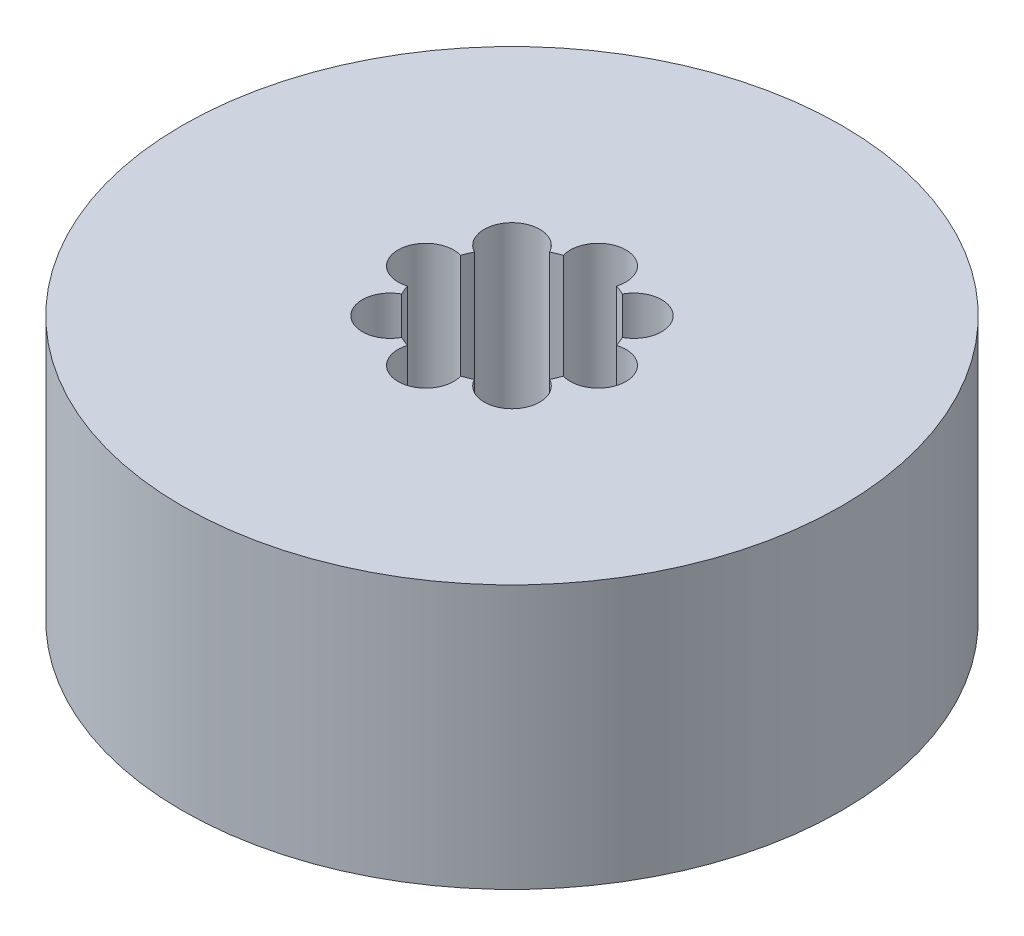
ISO-10303-21;
HEADER;
FILE_DESCRIPTION(('STEP AP214'),'2;1');
FILE_NAME('part.step','',(''),(''),'','','');
FILE_SCHEMA(('AUTOMOTIVE_DESIGN { 1 0 10303 214 1 1 1 1 }'));
ENDSEC;
DATA;
#1=APPLICATION_CONTEXT('core data for automotive mechanical design processes');
#2=APPLICATION_PROTOCOL_DEFINITION('international standard','automotive_design',2000,#1);
#3=PRODUCT_CONTEXT('',#1,'mechanical');
#4=PRODUCT('Part','Part','',(#3));
#5=PRODUCT_RELATED_PRODUCT_CATEGORY('part','',(#4));
#6=PRODUCT_DEFINITION_FORMATION('','',#4);
#7=PRODUCT_DEFINITION_CONTEXT('part definition',#1,'design');
#8=PRODUCT_DEFINITION('design','',#6,#7);
#9=PRODUCT_DEFINITION_SHAPE('','',#8);
#10=(LENGTH_UNIT() NAMED_UNIT(*) SI_UNIT(.MILLI.,.METRE.));
#11=(NAMED_UNIT(*) PLANE_ANGLE_UNIT() SI_UNIT($,.RADIAN.));
#12=(NAMED_UNIT(*) SI_UNIT($,.STERADIAN.) SOLID_ANGLE_UNIT());
#13=UNCERTAINTY_MEASURE_WITH_UNIT(LENGTH_MEASURE(1.E-05),#10,'distance_accuracy_value','');
#14=(GEOMETRIC_REPRESENTATION_CONTEXT(3) GLOBAL_UNCERTAINTY_ASSIGNED_CONTEXT((#13)) GLOBAL_UNIT_ASSIGNED_CONTEXT((#10,
#11,#12)) REPRESENTATION_CONTEXT('',''));
#15=CARTESIAN_POINT('',(0.,0.,0.));
#16=DIRECTION('',(0.,0.,1.));
#17=DIRECTION('',(1.,0.,0.));
#18=AXIS2_PLACEMENT_3D('',#15,#16,#17);
#19=CARTESIAN_POINT('',(0.,16.,0.));
#20=DIRECTION('',(0.,-1.,0.));
#21=DIRECTION('',(0.,0.,-1.));
#22=AXIS2_PLACEMENT_3D('',#19,#20,#21);
#23=CYLINDRICAL_SURFACE('',#22,20.);
#24=CARTESIAN_POINT('',(0.,16.,0.));
#25=DIRECTION('',(0.,1.,0.));
#26=DIRECTION('',(0.,0.,1.));
#27=AXIS2_PLACEMENT_3D('',#24,#25,#26);
#28=CIRCLE('',#27,20.);
#29=CARTESIAN_POINT('',(0.,16.,20.));
#30=VERTEX_POINT('',#29);
#31=EDGE_CURVE('E195',#30,#30,#28,.T.);
#32=ORIENTED_EDGE('',*,*,#31,.F.);
#33=EDGE_LOOP('',(#32));
#34=FACE_BOUND('',#33,.T.);
#35=CARTESIAN_POINT('',(0.,0.,0.));
#36=DIRECTION('',(0.,1.,0.));
#37=DIRECTION('',(0.,0.,1.));
#38=AXIS2_PLACEMENT_3D('',#35,#36,#37);
#39=CIRCLE('',#38,20.);
#40=CARTESIAN_POINT('',(0.,0.,20.));
#41=VERTEX_POINT('',#40);
#42=EDGE_CURVE('E179',#41,#41,#39,.T.);
#43=ORIENTED_EDGE('',*,*,#42,.T.);
#44=EDGE_LOOP('',(#43));
#45=FACE_BOUND('',#44,.T.);
#46=ADVANCED_FACE('F39',(#34,#45),#23,.T.);
#47=CARTESIAN_POINT('',(0.,16.,0.));
#48=DIRECTION('',(0.,1.,0.));
#49=DIRECTION('',(0.,0.,1.));
#50=AXIS2_PLACEMENT_3D('',#47,#48,#49);
#51=PLANE('',#50);
#52=CARTESIAN_POINT('',(0.,16.,5.22813348136023));
#53=DIRECTION('',(0.,1.,0.));
#54=DIRECTION('',(1.,0.,0.));
#55=AXIS2_PLACEMENT_3D('',#52,#53,#54);
#56=CIRCLE('',#55,1.68699486235413);
#57=CARTESIAN_POINT('',(-1.61263670500223,16.,4.73280074138766));
#58=VERTEX_POINT('',#57);
#59=CARTESIAN_POINT('',(1.61263670500226,16.,4.73280074138765));
#60=VERTEX_POINT('',#59);
#61=EDGE_CURVE('E176',#58,#60,#56,.T.);
#62=ORIENTED_EDGE('',*,*,#61,.F.);
#63=CARTESIAN_POINT('',(0.,16.,0.));
#64=DIRECTION('',(0.,1.,0.));
#65=DIRECTION('',(0.,0.,1.));
#66=AXIS2_PLACEMENT_3D('',#63,#64,#65);
#67=CIRCLE('',#66,5.);
#68=CARTESIAN_POINT('',(-2.2062891485425,16.,4.48690184793735));
#69=VERTEX_POINT('',#68);
#70=EDGE_CURVE('E166',#69,#58,#67,.T.);
#71=ORIENTED_EDGE('',*,*,#70,.F.);
#72=CARTESIAN_POINT('',(-3.69684863761824,16.,3.69684863761826));
#73=DIRECTION('',(0.,1.,0.));
#74=DIRECTION('',(0.707106781186549,0.,0.707106781186546));
#75=AXIS2_PLACEMENT_3D('',#72,#73,#74);
#76=CIRCLE('',#75,1.68699486235413);
#77=CARTESIAN_POINT('',(-4.48690184793734,16.,2.20628914854252));
#78=VERTEX_POINT('',#77);
#79=EDGE_CURVE('E147',#78,#69,#76,.T.);
#80=ORIENTED_EDGE('',*,*,#79,.F.);
#81=CARTESIAN_POINT('',(-4.73280074138765,16.,1.61263670500225));
#82=VERTEX_POINT('',#81);
#83=EDGE_CURVE('E180',#82,#78,#67,.T.);
#84=ORIENTED_EDGE('',*,*,#83,.F.);
#85=CARTESIAN_POINT('',(-5.22813348136023,16.,0.));
#86=DIRECTION('',(0.,1.,0.));
#87=DIRECTION('',(0.,0.,1.));
#88=AXIS2_PLACEMENT_3D('',#85,#86,#87);
#89=CIRCLE('',#88,1.68699486235413);
#90=CARTESIAN_POINT('',(-4.73280074138765,16.,-1.61263670500225));
#91=VERTEX_POINT('',#90);
#92=EDGE_CURVE('E186',#91,#82,#89,.T.);
#93=ORIENTED_EDGE('',*,*,#92,.F.);
#94=CARTESIAN_POINT('',(-4.48690184793737,16.,-2.20628914854245));
#95=VERTEX_POINT('',#94);
#96=EDGE_CURVE('E182',#95,#91,#67,.T.);
#97=ORIENTED_EDGE('',*,*,#96,.F.);
#98=CARTESIAN_POINT('',(-3.69684863761829,16.,-3.6968486376182));
#99=DIRECTION('',(0.,1.,0.));
#100=DIRECTION('',(-0.707106781186539,0.,0.707106781186556));
#101=AXIS2_PLACEMENT_3D('',#98,#99,#100);
#102=CIRCLE('',#101,1.68699486235413);
#103=CARTESIAN_POINT('',(-2.20628914854256,16.,-4.48690184793732));
#104=VERTEX_POINT('',#103);
#105=EDGE_CURVE('E446',#104,#95,#102,.T.);
#106=ORIENTED_EDGE('',*,*,#105,.F.);
#107=CARTESIAN_POINT('',(-1.6126367050023,16.,-4.73280074138763));
#108=VERTEX_POINT('',#107);
#109=EDGE_CURVE('E452',#108,#104,#67,.T.);
#110=ORIENTED_EDGE('',*,*,#109,.F.);
#111=CARTESIAN_POINT('',(0.,16.,-5.22813348136023));
#112=DIRECTION('',(0.,1.,0.));
#113=DIRECTION('',(-1.,0.,0.));
#114=AXIS2_PLACEMENT_3D('',#111,#112,#113);
#115=CIRCLE('',#114,1.68699486235413);
#116=CARTESIAN_POINT('',(1.6126367050022,16.,-4.73280074138767));
#117=VERTEX_POINT('',#116);
#118=EDGE_CURVE('E477',#117,#108,#115,.T.);
#119=ORIENTED_EDGE('',*,*,#118,.F.);
#120=CARTESIAN_POINT('',(2.20628914854247,16.,-4.48690184793737));
#121=VERTEX_POINT('',#120);
#122=EDGE_CURVE('E460',#121,#117,#67,.T.);
#123=ORIENTED_EDGE('',*,*,#122,.F.);
#124=CARTESIAN_POINT('',(3.69684863761822,16.,-3.69684863761828));
#125=DIRECTION('',(0.,1.,0.));
#126=DIRECTION('',(-0.707106781186554,0.,-0.707106781186541));
#127=AXIS2_PLACEMENT_3D('',#124,#125,#126);
#128=CIRCLE('',#127,1.68699486235413);
#129=CARTESIAN_POINT('',(4.48690184793733,16.,-2.20628914854255));
#130=VERTEX_POINT('',#129);
#131=EDGE_CURVE('E464',#130,#121,#128,.T.);
#132=ORIENTED_EDGE('',*,*,#131,.F.);
#133=CARTESIAN_POINT('',(4.73280074138765,16.,-1.61263670500225));
#134=VERTEX_POINT('',#133);
#135=EDGE_CURVE('E459',#134,#130,#67,.T.);
#136=ORIENTED_EDGE('',*,*,#135,.F.);
#137=CARTESIAN_POINT('',(5.22813348136023,16.,0.));
#138=DIRECTION('',(0.,1.,0.));
#139=DIRECTION('',(0.,0.,-1.));
#140=AXIS2_PLACEMENT_3D('',#137,#138,#139);
#141=CIRCLE('',#140,1.68699486235413);
#142=CARTESIAN_POINT('',(4.73280074138765,16.,1.61263670500225));
#143=VERTEX_POINT('',#142);
#144=EDGE_CURVE('E469',#143,#134,#141,.T.);
#145=ORIENTED_EDGE('',*,*,#144,.F.);
#146=CARTESIAN_POINT('',(4.48690184793736,16.,2.20628914854249));
#147=VERTEX_POINT('',#146);
#148=EDGE_CURVE('E181',#147,#143,#67,.T.);
#149=ORIENTED_EDGE('',*,*,#148,.F.);
#150=CARTESIAN_POINT('',(3.69684863761827,16.,3.69684863761823));
#151=DIRECTION('',(0.,1.,0.));
#152=DIRECTION('',(0.707106781186544,0.,-0.707106781186551));
#153=AXIS2_PLACEMENT_3D('',#150,#151,#152);
#154=CIRCLE('',#153,1.68699486235413);
#155=CARTESIAN_POINT('',(2.20628914854253,16.,4.48690184793734));
#156=VERTEX_POINT('',#155);
#157=EDGE_CURVE('E475',#156,#147,#154,.T.);
#158=ORIENTED_EDGE('',*,*,#157,.F.);
#159=EDGE_CURVE('E177',#60,#156,#67,.T.);
#160=ORIENTED_EDGE('',*,*,#159,.F.);
#161=EDGE_LOOP('',(#62,#71,#80,#84,#93,#97,#106,#110,#119,#123,#132,#136,#145,#149,#158,#160));
#162=FACE_BOUND('',#161,.T.);
#163=ORIENTED_EDGE('',*,*,#31,.T.);
#164=EDGE_LOOP('',(#163));
#165=FACE_BOUND('',#164,.T.);
#166=ADVANCED_FACE('F172',(#162,#165),#51,.T.);
#167=CARTESIAN_POINT('',(0.,0.,0.));
#168=DIRECTION('',(0.,1.,0.));
#169=DIRECTION('',(0.,0.,1.));
#170=AXIS2_PLACEMENT_3D('',#167,#168,#169);
#171=PLANE('',#170);
#172=CARTESIAN_POINT('',(0.,0.,0.));
#173=DIRECTION('',(0.,1.,0.));
#174=DIRECTION('',(0.,0.,1.));
#175=AXIS2_PLACEMENT_3D('',#172,#173,#174);
#176=CIRCLE('',#175,5.);
#177=CARTESIAN_POINT('',(0.,0.,5.));
#178=VERTEX_POINT('',#177);
#179=EDGE_CURVE('E187',#178,#178,#176,.T.);
#180=ORIENTED_EDGE('',*,*,#179,.T.);
#181=EDGE_LOOP('',(#180));
#182=FACE_BOUND('',#181,.T.);
#183=ORIENTED_EDGE('',*,*,#42,.F.);
#184=EDGE_LOOP('',(#183));
#185=FACE_BOUND('',#184,.T.);
#186=ADVANCED_FACE('F270',(#182,#185),#171,.F.);
#187=CARTESIAN_POINT('',(0.,16.,0.));
#188=DIRECTION('',(0.,-1.,0.));
#189=DIRECTION('',(0.,0.,-1.));
#190=AXIS2_PLACEMENT_3D('',#187,#188,#189);
#191=CYLINDRICAL_SURFACE('',#190,5.);
#192=DIRECTION('',(0.,1.,0.));
#193=VECTOR('',#192,1.);
#194=CARTESIAN_POINT('',(-1.61263670500223,9.82098684357305,4.73280074138766));
#195=LINE('',#194,#193);
#196=CARTESIAN_POINT('',(-1.61263670500223,3.64197368714609,4.73280074138766));
#197=VERTEX_POINT('',#196);
#198=EDGE_CURVE('E11',#197,#58,#195,.T.);
#199=ORIENTED_EDGE('',*,*,#198,.F.);
#200=CARTESIAN_POINT('',(0.,3.64197368714609,0.));
#201=DIRECTION('',(0.,1.,0.));
#202=DIRECTION('',(0.,0.,1.));
#203=AXIS2_PLACEMENT_3D('',#200,#201,#202);
#204=CIRCLE('',#203,5.);
#205=CARTESIAN_POINT('',(1.61263670500226,3.64197368714609,4.73280074138765));
#206=VERTEX_POINT('',#205);
#207=EDGE_CURVE('E250',#197,#206,#204,.T.);
#208=ORIENTED_EDGE('',*,*,#207,.T.);
#209=DIRECTION('',(0.,1.,0.));
#210=VECTOR('',#209,1.);
#211=CARTESIAN_POINT('',(1.61263670500226,9.82098684357305,4.73280074138765));
#212=LINE('',#211,#210);
#213=EDGE_CURVE('E46',#60,#206,#212,.F.);
#214=ORIENTED_EDGE('',*,*,#213,.F.);
#215=ORIENTED_EDGE('',*,*,#159,.T.);
#216=DIRECTION('',(0.,1.,0.));
#217=VECTOR('',#216,1.);
#218=CARTESIAN_POINT('',(2.20628914854253,9.82098684357305,4.48690184793734));
#219=LINE('',#218,#217);
#220=CARTESIAN_POINT('',(2.20628914854253,3.64197368714609,4.48690184793734));
#221=VERTEX_POINT('',#220);
#222=EDGE_CURVE('E244',#221,#156,#219,.T.);
#223=ORIENTED_EDGE('',*,*,#222,.F.);
#224=CARTESIAN_POINT('',(0.,3.64197368714609,0.));
#225=DIRECTION('',(0.,1.,0.));
#226=DIRECTION('',(0.,0.,1.));
#227=AXIS2_PLACEMENT_3D('',#224,#225,#226);
#228=CIRCLE('',#227,5.);
#229=CARTESIAN_POINT('',(4.48690184793736,3.64197368714609,2.20628914854249));
#230=VERTEX_POINT('',#229);
#231=EDGE_CURVE('E238',#221,#230,#228,.T.);
#232=ORIENTED_EDGE('',*,*,#231,.T.);
#233=DIRECTION('',(0.,1.,0.));
#234=VECTOR('',#233,1.);
#235=CARTESIAN_POINT('',(4.48690184793736,9.82098684357305,2.20628914854248));
#236=LINE('',#235,#234);
#237=EDGE_CURVE('E242',#147,#230,#236,.F.);
#238=ORIENTED_EDGE('',*,*,#237,.F.);
#239=ORIENTED_EDGE('',*,*,#148,.T.);
#240=DIRECTION('',(0.,1.,0.));
#241=VECTOR('',#240,1.);
#242=CARTESIAN_POINT('',(4.73280074138765,9.82098684357305,1.61263670500225));
#243=LINE('',#242,#241);
#244=CARTESIAN_POINT('',(4.73280074138765,3.64197368714609,1.61263670500225));
#245=VERTEX_POINT('',#244);
#246=EDGE_CURVE('E236',#245,#143,#243,.T.);
#247=ORIENTED_EDGE('',*,*,#246,.F.);
#248=CARTESIAN_POINT('',(0.,3.64197368714609,0.));
#249=DIRECTION('',(0.,1.,0.));
#250=DIRECTION('',(0.,0.,1.));
#251=AXIS2_PLACEMENT_3D('',#248,#249,#250);
#252=CIRCLE('',#251,5.);
#253=CARTESIAN_POINT('',(4.73280074138765,3.64197368714609,-1.61263670500225));
#254=VERTEX_POINT('',#253);
#255=EDGE_CURVE('E235',#245,#254,#252,.T.);
#256=ORIENTED_EDGE('',*,*,#255,.T.);
#257=DIRECTION('',(0.,1.,0.));
#258=VECTOR('',#257,1.);
#259=CARTESIAN_POINT('',(4.73280074138765,9.82098684357305,-1.61263670500225));
#260=LINE('',#259,#258);
#261=EDGE_CURVE('E234',#134,#254,#260,.F.);
#262=ORIENTED_EDGE('',*,*,#261,.F.);
#263=ORIENTED_EDGE('',*,*,#135,.T.);
#264=DIRECTION('',(0.,1.,0.));
#265=VECTOR('',#264,1.);
#266=CARTESIAN_POINT('',(4.48690184793733,9.82098684357305,-2.20628914854255));
#267=LINE('',#266,#265);
#268=CARTESIAN_POINT('',(4.48690184793733,3.64197368714609,-2.20628914854255));
#269=VERTEX_POINT('',#268);
#270=EDGE_CURVE('E229',#269,#130,#267,.T.);
#271=ORIENTED_EDGE('',*,*,#270,.F.);
#272=CARTESIAN_POINT('',(0.,3.64197368714609,0.));
#273=DIRECTION('',(0.,1.,0.));
#274=DIRECTION('',(0.,0.,1.));
#275=AXIS2_PLACEMENT_3D('',#272,#273,#274);
#276=CIRCLE('',#275,5.);
#277=CARTESIAN_POINT('',(2.20628914854247,3.64197368714609,-4.48690184793737));
#278=VERTEX_POINT('',#277);
#279=EDGE_CURVE('E221',#269,#278,#276,.T.);
#280=ORIENTED_EDGE('',*,*,#279,.T.);
#281=DIRECTION('',(0.,1.,0.));
#282=VECTOR('',#281,1.);
#283=CARTESIAN_POINT('',(2.20628914854247,9.82098684357305,-4.48690184793737));
#284=LINE('',#283,#282);
#285=EDGE_CURVE('E230',#121,#278,#284,.F.);
#286=ORIENTED_EDGE('',*,*,#285,.F.);
#287=ORIENTED_EDGE('',*,*,#122,.T.);
#288=DIRECTION('',(0.,1.,0.));
#289=VECTOR('',#288,1.);
#290=CARTESIAN_POINT('',(1.6126367050022,9.82098684357305,-4.73280074138767));
#291=LINE('',#290,#289);
#292=CARTESIAN_POINT('',(1.6126367050022,3.64197368714609,-4.73280074138767));
#293=VERTEX_POINT('',#292);
#294=EDGE_CURVE('E225',#293,#117,#291,.T.);
#295=ORIENTED_EDGE('',*,*,#294,.F.);
#296=CARTESIAN_POINT('',(0.,3.64197368714609,0.));
#297=DIRECTION('',(0.,1.,0.));
#298=DIRECTION('',(0.,0.,1.));
#299=AXIS2_PLACEMENT_3D('',#296,#297,#298);
#300=CIRCLE('',#299,5.);
#301=CARTESIAN_POINT('',(-1.6126367050023,3.64197368714609,-4.73280074138763));
#302=VERTEX_POINT('',#301);
#303=EDGE_CURVE('E216',#293,#302,#300,.T.);
#304=ORIENTED_EDGE('',*,*,#303,.T.);
#305=DIRECTION('',(0.,1.,0.));
#306=VECTOR('',#305,1.);
#307=CARTESIAN_POINT('',(-1.6126367050023,9.82098684357305,-4.73280074138763));
#308=LINE('',#307,#306);
#309=EDGE_CURVE('E218',#108,#302,#308,.F.);
#310=ORIENTED_EDGE('',*,*,#309,.F.);
#311=ORIENTED_EDGE('',*,*,#109,.T.);
#312=DIRECTION('',(0.,1.,0.));
#313=VECTOR('',#312,1.);
#314=CARTESIAN_POINT('',(-2.20628914854256,9.82098684357305,-4.48690184793732));
#315=LINE('',#314,#313);
#316=CARTESIAN_POINT('',(-2.20628914854256,3.64197368714609,-4.48690184793732));
#317=VERTEX_POINT('',#316);
#318=EDGE_CURVE('E212',#317,#104,#315,.T.);
#319=ORIENTED_EDGE('',*,*,#318,.F.);
#320=CARTESIAN_POINT('',(0.,3.64197368714609,0.));
#321=DIRECTION('',(0.,1.,0.));
#322=DIRECTION('',(0.,0.,1.));
#323=AXIS2_PLACEMENT_3D('',#320,#321,#322);
#324=CIRCLE('',#323,5.);
#325=CARTESIAN_POINT('',(-4.48690184793737,3.64197368714609,-2.20628914854245));
#326=VERTEX_POINT('',#325);
#327=EDGE_CURVE('E208',#317,#326,#324,.T.);
#328=ORIENTED_EDGE('',*,*,#327,.T.);
#329=DIRECTION('',(0.,1.,0.));
#330=VECTOR('',#329,1.);
#331=CARTESIAN_POINT('',(-4.48690184793737,9.82098684357305,-2.20628914854245));
#332=LINE('',#331,#330);
#333=EDGE_CURVE('E211',#95,#326,#332,.F.);
#334=ORIENTED_EDGE('',*,*,#333,.F.);
#335=ORIENTED_EDGE('',*,*,#96,.T.);
#336=DIRECTION('',(0.,1.,0.));
#337=VECTOR('',#336,1.);
#338=CARTESIAN_POINT('',(-4.73280074138765,9.82098684357305,-1.61263670500225));
#339=LINE('',#338,#337);
#340=CARTESIAN_POINT('',(-4.73280074138765,3.64197368714609,-1.61263670500225));
#341=VERTEX_POINT('',#340);
#342=EDGE_CURVE('E201',#341,#91,#339,.T.);
#343=ORIENTED_EDGE('',*,*,#342,.F.);
#344=CARTESIAN_POINT('',(0.,3.64197368714609,0.));
#345=DIRECTION('',(0.,1.,0.));
#346=DIRECTION('',(0.,0.,1.));
#347=AXIS2_PLACEMENT_3D('',#344,#345,#346);
#348=CIRCLE('',#347,5.);
#349=CARTESIAN_POINT('',(-4.73280074138765,3.64197368714609,1.61263670500225));
#350=VERTEX_POINT('',#349);
#351=EDGE_CURVE('E194',#341,#350,#348,.T.);
#352=ORIENTED_EDGE('',*,*,#351,.T.);
#353=DIRECTION('',(0.,1.,0.));
#354=VECTOR('',#353,1.);
#355=CARTESIAN_POINT('',(-4.73280074138765,9.82098684357305,1.61263670500225));
#356=LINE('',#355,#354);
#357=EDGE_CURVE('E199',#82,#350,#356,.F.);
#358=ORIENTED_EDGE('',*,*,#357,.F.);
#359=ORIENTED_EDGE('',*,*,#83,.T.);
#360=DIRECTION('',(0.,1.,0.));
#361=VECTOR('',#360,1.);
#362=CARTESIAN_POINT('',(-4.48690184793734,9.82098684357305,2.20628914854252));
#363=LINE('',#362,#361);
#364=CARTESIAN_POINT('',(-4.48690184793734,3.64197368714609,2.20628914854252));
#365=VERTEX_POINT('',#364);
#366=EDGE_CURVE('E160',#365,#78,#363,.T.);
#367=ORIENTED_EDGE('',*,*,#366,.F.);
#368=CARTESIAN_POINT('',(0.,3.64197368714609,0.));
#369=DIRECTION('',(0.,1.,0.));
#370=DIRECTION('',(0.,0.,1.));
#371=AXIS2_PLACEMENT_3D('',#368,#369,#370);
#372=CIRCLE('',#371,5.);
#373=CARTESIAN_POINT('',(-2.2062891485425,3.64197368714609,4.48690184793735));
#374=VERTEX_POINT('',#373);
#375=EDGE_CURVE('E168',#365,#374,#372,.T.);
#376=ORIENTED_EDGE('',*,*,#375,.T.);
#377=DIRECTION('',(0.,1.,0.));
#378=VECTOR('',#377,1.);
#379=CARTESIAN_POINT('',(-2.2062891485425,9.82098684357305,4.48690184793735));
#380=LINE('',#379,#378);
#381=EDGE_CURVE('E152',#69,#374,#380,.F.);
#382=ORIENTED_EDGE('',*,*,#381,.F.);
#383=ORIENTED_EDGE('',*,*,#70,.T.);
#384=EDGE_LOOP('',(#199,#208,#214,#215,#223,#232,#238,#239,#247,#256,#262,#263,#271,#280,#286,
#287,#295,#304,#310,#311,#319,#328,#334,#335,#343,#352,#358,#359,#367,#376,#382,#383));
#385=FACE_BOUND('',#384,.T.);
#386=ORIENTED_EDGE('',*,*,#179,.F.);
#387=EDGE_LOOP('',(#386));
#388=FACE_BOUND('',#387,.T.);
#389=ADVANCED_FACE('F170',(#385,#388),#191,.F.);
#390=CARTESIAN_POINT('',(-5.22813348136023,3.64197368714609,0.));
#391=DIRECTION('',(0.,1.,0.));
#392=DIRECTION('',(0.,0.,1.));
#393=AXIS2_PLACEMENT_3D('',#390,#391,#392);
#394=CYLINDRICAL_SURFACE('',#393,1.68699486235413);
#395=ORIENTED_EDGE('',*,*,#342,.T.);
#396=ORIENTED_EDGE('',*,*,#92,.T.);
#397=ORIENTED_EDGE('',*,*,#357,.T.);
#398=CARTESIAN_POINT('',(-5.22813348136023,3.64197368714609,0.));
#399=DIRECTION('',(0.,1.,0.));
#400=DIRECTION('',(0.,0.,1.));
#401=AXIS2_PLACEMENT_3D('',#398,#399,#400);
#402=CIRCLE('',#401,1.68699486235413);
#403=EDGE_CURVE('E191',#341,#350,#402,.T.);
#404=ORIENTED_EDGE('',*,*,#403,.F.);
#405=EDGE_LOOP('',(#395,#396,#397,#404));
#406=FACE_BOUND('',#405,.T.);
#407=ADVANCED_FACE('F279',(#406),#394,.F.);
#408=CARTESIAN_POINT('',(-5.22813348136023,3.64197368714609,0.));
#409=DIRECTION('',(0.,1.,0.));
#410=DIRECTION('',(0.,0.,1.));
#411=AXIS2_PLACEMENT_3D('',#408,#409,#410);
#412=PLANE('',#411);
#413=ORIENTED_EDGE('',*,*,#403,.T.);
#414=ORIENTED_EDGE('',*,*,#351,.F.);
#415=EDGE_LOOP('',(#413,#414));
#416=FACE_BOUND('',#415,.T.);
#417=ADVANCED_FACE('F285',(#416),#412,.T.);
#418=CARTESIAN_POINT('',(-3.69684863761824,3.64197368714609,3.69684863761826));
#419=DIRECTION('',(0.,1.,0.));
#420=DIRECTION('',(0.,0.,1.));
#421=AXIS2_PLACEMENT_3D('',#418,#419,#420);
#422=CYLINDRICAL_SURFACE('',#421,1.68699486235413);
#423=ORIENTED_EDGE('',*,*,#366,.T.);
#424=ORIENTED_EDGE('',*,*,#79,.T.);
#425=ORIENTED_EDGE('',*,*,#381,.T.);
#426=CARTESIAN_POINT('',(-3.69684863761824,3.64197368714609,3.69684863761826));
#427=DIRECTION('',(0.,1.,0.));
#428=DIRECTION('',(0.707106781186549,0.,0.707106781186546));
#429=AXIS2_PLACEMENT_3D('',#426,#427,#428);
#430=CIRCLE('',#429,1.68699486235413);
#431=EDGE_CURVE('E165',#365,#374,#430,.T.);
#432=ORIENTED_EDGE('',*,*,#431,.F.);
#433=EDGE_LOOP('',(#423,#424,#425,#432));
#434=FACE_BOUND('',#433,.T.);
#435=ADVANCED_FACE('F155',(#434),#422,.F.);
#436=CARTESIAN_POINT('',(-3.69684863761824,3.64197368714609,3.69684863761826));
#437=DIRECTION('',(0.,1.,0.));
#438=DIRECTION('',(0.707106781186549,0.,0.707106781186546));
#439=AXIS2_PLACEMENT_3D('',#436,#437,#438);
#440=PLANE('',#439);
#441=ORIENTED_EDGE('',*,*,#431,.T.);
#442=ORIENTED_EDGE('',*,*,#375,.F.);
#443=EDGE_LOOP('',(#441,#442));
#444=FACE_BOUND('',#443,.T.);
#445=ADVANCED_FACE('F288',(#444),#440,.T.);
#446=CARTESIAN_POINT('',(-3.69684863761829,3.64197368714609,-3.6968486376182));
#447=DIRECTION('',(0.,1.,0.));
#448=DIRECTION('',(0.,0.,1.));
#449=AXIS2_PLACEMENT_3D('',#446,#447,#448);
#450=CYLINDRICAL_SURFACE('',#449,1.68699486235413);
#451=ORIENTED_EDGE('',*,*,#318,.T.);
#452=ORIENTED_EDGE('',*,*,#105,.T.);
#453=ORIENTED_EDGE('',*,*,#333,.T.);
#454=CARTESIAN_POINT('',(-3.69684863761829,3.64197368714609,-3.6968486376182));
#455=DIRECTION('',(0.,1.,0.));
#456=DIRECTION('',(-0.707106781186539,0.,0.707106781186556));
#457=AXIS2_PLACEMENT_3D('',#454,#455,#456);
#458=CIRCLE('',#457,1.68699486235413);
#459=EDGE_CURVE('E447',#317,#326,#458,.T.);
#460=ORIENTED_EDGE('',*,*,#459,.F.);
#461=EDGE_LOOP('',(#451,#452,#453,#460));
#462=FACE_BOUND('',#461,.T.);
#463=ADVANCED_FACE('F295',(#462),#450,.F.);
#464=CARTESIAN_POINT('',(-3.69684863761829,3.64197368714609,-3.6968486376182));
#465=DIRECTION('',(0.,1.,0.));
#466=DIRECTION('',(-0.707106781186539,0.,0.707106781186556));
#467=AXIS2_PLACEMENT_3D('',#464,#465,#466);
#468=PLANE('',#467);
#469=ORIENTED_EDGE('',*,*,#459,.T.);
#470=ORIENTED_EDGE('',*,*,#327,.F.);
#471=EDGE_LOOP('',(#469,#470));
#472=FACE_BOUND('',#471,.T.);
#473=ADVANCED_FACE('F375',(#472),#468,.T.);
#474=CARTESIAN_POINT('',(0.,3.64197368714609,-5.22813348136023));
#475=DIRECTION('',(0.,1.,0.));
#476=DIRECTION('',(0.,0.,1.));
#477=AXIS2_PLACEMENT_3D('',#474,#475,#476);
#478=CYLINDRICAL_SURFACE('',#477,1.68699486235413);
#479=ORIENTED_EDGE('',*,*,#294,.T.);
#480=ORIENTED_EDGE('',*,*,#118,.T.);
#481=ORIENTED_EDGE('',*,*,#309,.T.);
#482=CARTESIAN_POINT('',(0.,3.64197368714609,-5.22813348136023));
#483=DIRECTION('',(0.,1.,0.));
#484=DIRECTION('',(-1.,0.,0.));
#485=AXIS2_PLACEMENT_3D('',#482,#483,#484);
#486=CIRCLE('',#485,1.68699486235413);
#487=EDGE_CURVE('E467',#293,#302,#486,.T.);
#488=ORIENTED_EDGE('',*,*,#487,.F.);
#489=EDGE_LOOP('',(#479,#480,#481,#488));
#490=FACE_BOUND('',#489,.T.);
#491=ADVANCED_FACE('F361',(#490),#478,.F.);
#492=CARTESIAN_POINT('',(0.,3.64197368714609,-5.22813348136023));
#493=DIRECTION('',(0.,1.,0.));
#494=DIRECTION('',(-1.,0.,0.));
#495=AXIS2_PLACEMENT_3D('',#492,#493,#494);
#496=PLANE('',#495);
#497=ORIENTED_EDGE('',*,*,#487,.T.);
#498=ORIENTED_EDGE('',*,*,#303,.F.);
#499=EDGE_LOOP('',(#497,#498));
#500=FACE_BOUND('',#499,.T.);
#501=ADVANCED_FACE('F297',(#500),#496,.T.);
#502=CARTESIAN_POINT('',(3.69684863761822,3.64197368714609,-3.69684863761828));
#503=DIRECTION('',(0.,1.,0.));
#504=DIRECTION('',(0.,0.,1.));
#505=AXIS2_PLACEMENT_3D('',#502,#503,#504);
#506=CYLINDRICAL_SURFACE('',#505,1.68699486235413);
#507=ORIENTED_EDGE('',*,*,#270,.T.);
#508=ORIENTED_EDGE('',*,*,#131,.T.);
#509=ORIENTED_EDGE('',*,*,#285,.T.);
#510=CARTESIAN_POINT('',(3.69684863761822,3.64197368714609,-3.69684863761828));
#511=DIRECTION('',(0.,1.,0.));
#512=DIRECTION('',(-0.707106781186554,0.,-0.707106781186541));
#513=AXIS2_PLACEMENT_3D('',#510,#511,#512);
#514=CIRCLE('',#513,1.68699486235413);
#515=EDGE_CURVE('E470',#269,#278,#514,.T.);
#516=ORIENTED_EDGE('',*,*,#515,.F.);
#517=EDGE_LOOP('',(#507,#508,#509,#516));
#518=FACE_BOUND('',#517,.T.);
#519=ADVANCED_FACE('F294',(#518),#506,.F.);
#520=CARTESIAN_POINT('',(3.69684863761822,3.64197368714609,-3.69684863761828));
#521=DIRECTION('',(0.,1.,0.));
#522=DIRECTION('',(-0.707106781186554,0.,-0.707106781186541));
#523=AXIS2_PLACEMENT_3D('',#520,#521,#522);
#524=PLANE('',#523);
#525=ORIENTED_EDGE('',*,*,#515,.T.);
#526=ORIENTED_EDGE('',*,*,#279,.F.);
#527=EDGE_LOOP('',(#525,#526));
#528=FACE_BOUND('',#527,.T.);
#529=ADVANCED_FACE('F300',(#528),#524,.T.);
#530=CARTESIAN_POINT('',(5.22813348136023,3.64197368714609,0.));
#531=DIRECTION('',(0.,1.,0.));
#532=DIRECTION('',(0.,0.,1.));
#533=AXIS2_PLACEMENT_3D('',#530,#531,#532);
#534=CYLINDRICAL_SURFACE('',#533,1.68699486235413);
#535=ORIENTED_EDGE('',*,*,#246,.T.);
#536=ORIENTED_EDGE('',*,*,#144,.T.);
#537=ORIENTED_EDGE('',*,*,#261,.T.);
#538=CARTESIAN_POINT('',(5.22813348136023,3.64197368714609,0.));
#539=DIRECTION('',(0.,1.,0.));
#540=DIRECTION('',(0.,0.,-1.));
#541=AXIS2_PLACEMENT_3D('',#538,#539,#540);
#542=CIRCLE('',#541,1.68699486235413);
#543=EDGE_CURVE('E472',#245,#254,#542,.T.);
#544=ORIENTED_EDGE('',*,*,#543,.F.);
#545=EDGE_LOOP('',(#535,#536,#537,#544));
#546=FACE_BOUND('',#545,.T.);
#547=ADVANCED_FACE('F305',(#546),#534,.F.);
#548=CARTESIAN_POINT('',(5.22813348136023,3.64197368714609,0.));
#549=DIRECTION('',(0.,1.,0.));
#550=DIRECTION('',(0.,0.,-1.));
#551=AXIS2_PLACEMENT_3D('',#548,#549,#550);
#552=PLANE('',#551);
#553=ORIENTED_EDGE('',*,*,#543,.T.);
#554=ORIENTED_EDGE('',*,*,#255,.F.);
#555=EDGE_LOOP('',(#553,#554));
#556=FACE_BOUND('',#555,.T.);
#557=ADVANCED_FACE('F308',(#556),#552,.T.);
#558=CARTESIAN_POINT('',(3.69684863761827,3.64197368714609,3.69684863761823));
#559=DIRECTION('',(0.,1.,0.));
#560=DIRECTION('',(0.,0.,1.));
#561=AXIS2_PLACEMENT_3D('',#558,#559,#560);
#562=CYLINDRICAL_SURFACE('',#561,1.68699486235413);
#563=ORIENTED_EDGE('',*,*,#222,.T.);
#564=ORIENTED_EDGE('',*,*,#157,.T.);
#565=ORIENTED_EDGE('',*,*,#237,.T.);
#566=CARTESIAN_POINT('',(3.69684863761827,3.64197368714609,3.69684863761823));
#567=DIRECTION('',(0.,1.,0.));
#568=DIRECTION('',(0.707106781186544,0.,-0.707106781186551));
#569=AXIS2_PLACEMENT_3D('',#566,#567,#568);
#570=CIRCLE('',#569,1.68699486235413);
#571=EDGE_CURVE('E56',#221,#230,#570,.T.);
#572=ORIENTED_EDGE('',*,*,#571,.F.);
#573=EDGE_LOOP('',(#563,#564,#565,#572));
#574=FACE_BOUND('',#573,.T.);
#575=ADVANCED_FACE('F309',(#574),#562,.F.);
#576=CARTESIAN_POINT('',(3.69684863761827,3.64197368714609,3.69684863761823));
#577=DIRECTION('',(0.,1.,0.));
#578=DIRECTION('',(0.707106781186544,0.,-0.707106781186551));
#579=AXIS2_PLACEMENT_3D('',#576,#577,#578);
#580=PLANE('',#579);
#581=ORIENTED_EDGE('',*,*,#571,.T.);
#582=ORIENTED_EDGE('',*,*,#231,.F.);
#583=EDGE_LOOP('',(#581,#582));
#584=FACE_BOUND('',#583,.T.);
#585=ADVANCED_FACE('F256',(#584),#580,.T.);
#586=CARTESIAN_POINT('',(0.,3.64197368714609,5.22813348136023));
#587=DIRECTION('',(0.,1.,0.));
#588=DIRECTION('',(0.,0.,1.));
#589=AXIS2_PLACEMENT_3D('',#586,#587,#588);
#590=CYLINDRICAL_SURFACE('',#589,1.68699486235413);
#591=ORIENTED_EDGE('',*,*,#198,.T.);
#592=ORIENTED_EDGE('',*,*,#61,.T.);
#593=ORIENTED_EDGE('',*,*,#213,.T.);
#594=CARTESIAN_POINT('',(0.,3.64197368714609,5.22813348136023));
#595=DIRECTION('',(0.,1.,0.));
#596=DIRECTION('',(1.,0.,0.));
#597=AXIS2_PLACEMENT_3D('',#594,#595,#596);
#598=CIRCLE('',#597,1.68699486235413);
#599=EDGE_CURVE('E55',#197,#206,#598,.T.);
#600=ORIENTED_EDGE('',*,*,#599,.F.);
#601=EDGE_LOOP('',(#591,#592,#593,#600));
#602=FACE_BOUND('',#601,.T.);
#603=ADVANCED_FACE('F253',(#602),#590,.F.);
#604=CARTESIAN_POINT('',(0.,3.64197368714609,5.22813348136023));
#605=DIRECTION('',(0.,1.,0.));
#606=DIRECTION('',(1.,0.,0.));
#607=AXIS2_PLACEMENT_3D('',#604,#605,#606);
#608=PLANE('',#607);
#609=ORIENTED_EDGE('',*,*,#599,.T.);
#610=ORIENTED_EDGE('',*,*,#207,.F.);
#611=EDGE_LOOP('',(#609,#610));
#612=FACE_BOUND('',#611,.T.);
#613=ADVANCED_FACE('F252',(#612),#608,.T.);
#614=CLOSED_SHELL('',(#46,#166,#186,#389,#407,#417,#435,#445,#463,#473,#491,#501,#519,#529,#547,
#557,#575,#585,#603,#613));
#615=MANIFOLD_SOLID_BREP('B2',#614);
#616=ADVANCED_BREP_SHAPE_REPRESENTATION('',(#18,#615),#14);
#617=SHAPE_DEFINITION_REPRESENTATION(#9,#616);
ENDSEC;
END-ISO-10303-21;
